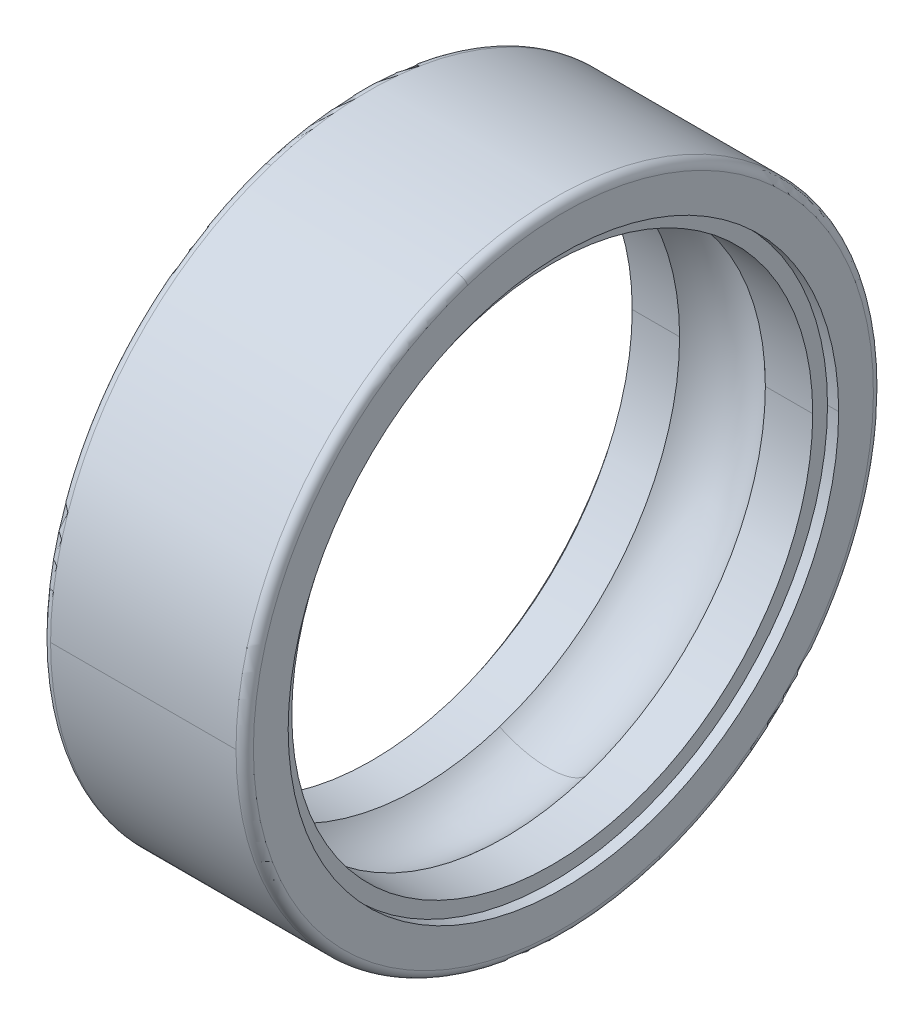
ISO-10303-21;
HEADER;
FILE_DESCRIPTION(('STEP AP214'),'2;1');
FILE_NAME('part.step','',(''),(''),'','','');
FILE_SCHEMA(('AUTOMOTIVE_DESIGN { 1 0 10303 214 1 1 1 1 }'));
ENDSEC;
DATA;
#1=APPLICATION_CONTEXT('core data for automotive mechanical design processes');
#2=APPLICATION_PROTOCOL_DEFINITION('international standard','automotive_design',2000,#1);
#3=PRODUCT_CONTEXT('',#1,'mechanical');
#4=PRODUCT('Part','Part','',(#3));
#5=PRODUCT_RELATED_PRODUCT_CATEGORY('part','',(#4));
#6=PRODUCT_DEFINITION_FORMATION('','',#4);
#7=PRODUCT_DEFINITION_CONTEXT('part definition',#1,'design');
#8=PRODUCT_DEFINITION('design','',#6,#7);
#9=PRODUCT_DEFINITION_SHAPE('','',#8);
#10=(LENGTH_UNIT() NAMED_UNIT(*) SI_UNIT(.MILLI.,.METRE.));
#11=(NAMED_UNIT(*) PLANE_ANGLE_UNIT() SI_UNIT($,.RADIAN.));
#12=(NAMED_UNIT(*) SI_UNIT($,.STERADIAN.) SOLID_ANGLE_UNIT());
#13=UNCERTAINTY_MEASURE_WITH_UNIT(LENGTH_MEASURE(1.E-05),#10,'distance_accuracy_value','');
#14=(GEOMETRIC_REPRESENTATION_CONTEXT(3) GLOBAL_UNCERTAINTY_ASSIGNED_CONTEXT((#13)) GLOBAL_UNIT_ASSIGNED_CONTEXT((#10,
#11,#12)) REPRESENTATION_CONTEXT('',''));
#15=CARTESIAN_POINT('',(0.,0.,0.));
#16=DIRECTION('',(0.,0.,1.));
#17=DIRECTION('',(1.,0.,0.));
#18=AXIS2_PLACEMENT_3D('',#15,#16,#17);
#19=CARTESIAN_POINT('',(0.,10.7,0.));
#20=DIRECTION('',(-1.,0.,0.));
#21=DIRECTION('',(0.,0.,1.));
#22=AXIS2_PLACEMENT_3D('',#19,#20,#21);
#23=PLANE('',#22);
#24=CARTESIAN_POINT('',(0.,0.,0.));
#25=DIRECTION('',(1.,0.,0.));
#26=DIRECTION('',(0.,0.,-1.));
#27=AXIS2_PLACEMENT_3D('',#24,#25,#26);
#28=CIRCLE('',#27,9.5);
#29=CARTESIAN_POINT('',(0.,0.,-9.5));
#30=VERTEX_POINT('',#29);
#31=CARTESIAN_POINT('',(0.,0.,9.5));
#32=VERTEX_POINT('',#31);
#33=EDGE_CURVE('E11',#30,#32,#28,.T.);
#34=ORIENTED_EDGE('',*,*,#33,.T.);
#35=CARTESIAN_POINT('',(0.,0.,0.));
#36=DIRECTION('',(1.,0.,0.));
#37=DIRECTION('',(0.,0.,-1.));
#38=AXIS2_PLACEMENT_3D('',#35,#36,#37);
#39=CIRCLE('',#38,9.5);
#40=EDGE_CURVE('E26',#32,#30,#39,.T.);
#41=ORIENTED_EDGE('',*,*,#40,.T.);
#42=EDGE_LOOP('',(#34,#41));
#43=FACE_BOUND('',#42,.T.);
#44=CARTESIAN_POINT('',(0.,10.1763047243581,3.30648183981196));
#45=CARTESIAN_POINT('',(0.,10.1222060192153,3.4729925522832));
#46=CARTESIAN_POINT('',(0.,10.0640137178569,3.63817284244062));
#47=CARTESIAN_POINT('',(0.,9.93959737326859,3.96548044496034));
#48=CARTESIAN_POINT('',(0.,9.87337333003879,4.12760775732264));
#49=CARTESIAN_POINT('',(0.,9.73304895226789,4.44841727108463));
#50=CARTESIAN_POINT('',(0.,9.65894861772679,4.60709947248432));
#51=CARTESIAN_POINT('',(0.,9.5030512671633,4.92063690146475));
#52=CARTESIAN_POINT('',(0.,9.42125425114093,5.07549212904549));
#53=CARTESIAN_POINT('',(0.,9.2501603002169,5.38100243898939));
#54=CARTESIAN_POINT('',(0.,9.16086336531526,5.53165752135256));
#55=CARTESIAN_POINT('',(0.,8.97498477943333,5.82840462947298));
#56=CARTESIAN_POINT('',(0.,8.87840312845304,5.97449665523024));
#57=CARTESIAN_POINT('',(0.,8.67818776299292,6.26176569364071));
#58=CARTESIAN_POINT('',(0.,8.57455404851308,6.40294270629393));
#59=CARTESIAN_POINT('',(0.,8.36048422439702,6.68004161285399));
#60=CARTESIAN_POINT('',(0.,8.25004811476079,6.81596350676083));
#61=CARTESIAN_POINT('',(0.,8.02263954907983,7.08222472750514));
#62=CARTESIAN_POINT('',(0.,7.90566709303509,7.2125640543426));
#63=CARTESIAN_POINT('',(0.,7.66546763183478,7.46734614224756));
#64=CARTESIAN_POINT('',(0.,7.5422406266792,7.59178890331505));
#65=CARTESIAN_POINT('',(0.,7.28982893179738,7.83447806612745));
#66=CARTESIAN_POINT('',(0.,7.16064424207114,7.95272446787235));
#67=CARTESIAN_POINT('',(0.,6.89662839530991,8.18273604611169));
#68=CARTESIAN_POINT('',(0.,6.76179723827492,8.29450122260611));
#69=CARTESIAN_POINT('',(0.,6.48681327695549,8.51128109824186));
#70=CARTESIAN_POINT('',(0.,6.34666047267106,8.61629579738319));
#71=CARTESIAN_POINT('',(0.,6.0613708572363,8.81932172870511));
#72=CARTESIAN_POINT('',(0.,5.91623404608597,8.91733296088571));
#73=CARTESIAN_POINT('',(0.,5.6213260642094,9.10611584064285));
#74=CARTESIAN_POINT('',(0.,5.47155489348316,9.19688748821941));
#75=CARTESIAN_POINT('',(0.,5.1677390043236,9.37097252191886));
#76=CARTESIAN_POINT('',(0.,5.01369428589029,9.45428590804176));
#77=CARTESIAN_POINT('',(0.,4.70170240853597,9.61325370958933));
#78=CARTESIAN_POINT('',(0.,4.54375524961497,9.688908125014));
#79=CARTESIAN_POINT('',(0.,4.22433899982567,9.83237572705182));
#80=CARTESIAN_POINT('',(0.,4.06286990895737,9.90018891366497));
#81=CARTESIAN_POINT('',(0.,3.73679878845639,10.0278106901734));
#82=CARTESIAN_POINT('',(0.,3.57219675882372,10.0876192800688));
#83=CARTESIAN_POINT('',(0.,3.24025630150081,10.19908777901));
#84=CARTESIAN_POINT('',(0.,3.07291787381057,10.2507476880558));
#85=CARTESIAN_POINT('',(0.,2.73590775330198,10.3457943720523));
#86=CARTESIAN_POINT('',(0.,2.56623606048361,10.3891811470029));
#87=CARTESIAN_POINT('',(0.,2.22496816368822,10.4675770402677));
#88=CARTESIAN_POINT('',(0.,2.0533719597112,10.502586158582));
#89=CARTESIAN_POINT('',(0.,1.70866843088395,10.5641423985417));
#90=CARTESIAN_POINT('',(0.,1.53556110603371,10.5906895201872));
#91=CARTESIAN_POINT('',(0.,1.18825236616799,10.635257812468));
#92=CARTESIAN_POINT('',(0.,1.01405095115252,10.6532789831034));
#93=CARTESIAN_POINT('',(0.,0.664973697423329,10.6807519587855));
#94=CARTESIAN_POINT('',(0.,0.490097858709621,10.6902037638323));
#95=CARTESIAN_POINT('',(0.,0.140093048796752,10.700515238111));
#96=CARTESIAN_POINT('',(0.,-0.0350359224024079,10.7013749073429));
#97=CARTESIAN_POINT('',(0.,-0.385125096255075,10.6945000389733));
#98=CARTESIAN_POINT('',(0.,-0.560085298908583,10.6867655013719));
#99=CARTESIAN_POINT('',(0.,-0.909415441217051,10.6627208525142));
#100=CARTESIAN_POINT('',(0.,-1.08378538087201,10.646410741258));
#101=CARTESIAN_POINT('',(0.,-1.43151492472575,10.6052542375774));
#102=CARTESIAN_POINT('',(0.,-1.60487452892453,10.580407845153));
#103=CARTESIAN_POINT('',(0.,-1.95016576339489,10.5222386362717));
#104=CARTESIAN_POINT('',(0.,-2.12209739366647,10.4889158198147));
#105=CARTESIAN_POINT('',(0.,-2.46411848192566,10.4138740404519));
#106=CARTESIAN_POINT('',(0.,-2.63420793991328,10.372155077546));
#107=CARTESIAN_POINT('',(0.,-2.97213492320218,10.2804215099211));
#108=CARTESIAN_POINT('',(0.,-3.13997244850347,10.230406905202));
#109=CARTESIAN_POINT('',(0.,-3.47299123112044,10.1222025435143));
#110=CARTESIAN_POINT('',(0.,-3.63817248843612,10.0640127865456));
#111=CARTESIAN_POINT('',(0.,-3.96548079896482,9.93959830457988));
#112=CARTESIAN_POINT('',(0.,-4.12760785217784,9.87337357958291));
#113=CARTESIAN_POINT('',(0.,-4.4484171762294,9.73304870272379));
#114=CARTESIAN_POINT('',(0.,-4.60709944706793,9.65894855086165));
#115=CARTESIAN_POINT('',(0.,-4.92063692688112,9.50305133402845));
#116=CARTESIAN_POINT('',(0.,-5.07549213585578,9.42125426905739));
#117=CARTESIAN_POINT('',(0.,-5.38100243217909,9.25016028230045));
#118=CARTESIAN_POINT('',(0.,-5.53165751952774,9.16086336051456));
#119=CARTESIAN_POINT('',(0.,-5.82840463129779,8.97498478423404));
#120=CARTESIAN_POINT('',(0.,-5.97449665571919,8.87840312973939));
#121=CARTESIAN_POINT('',(0.,-6.26176569315174,8.67818776170658));
#122=CARTESIAN_POINT('',(0.,-6.4029427061629,8.57455404816841));
#123=CARTESIAN_POINT('',(0.,-6.68004161298499,8.3604842247417));
#124=CARTESIAN_POINT('',(0.,-6.81596350679593,8.25004811485316));
#125=CARTESIAN_POINT('',(0.,-7.08222472747002,8.02263954898748));
#126=CARTESIAN_POINT('',(0.,-7.21256405433319,7.90566709301036));
#127=CARTESIAN_POINT('',(0.,-7.46734614225696,7.66546763185953));
#128=CARTESIAN_POINT('',(0.,-7.59178890331756,7.54224062668583));
#129=CARTESIAN_POINT('',(0.,-7.83447806612492,7.28982893179075));
#130=CARTESIAN_POINT('',(0.,-7.95272446787167,7.16064424206937));
#131=CARTESIAN_POINT('',(0.,-8.18273604611236,6.89662839531169));
#132=CARTESIAN_POINT('',(0.,-8.29450122260629,6.7617972382754));
#133=CARTESIAN_POINT('',(0.,-8.51128109824167,6.48681327695502));
#134=CARTESIAN_POINT('',(0.,-8.61629579738313,6.34666047267094));
#135=CARTESIAN_POINT('',(0.,-8.81932172870515,6.06137085723643));
#136=CARTESIAN_POINT('',(0.,-8.91733296088571,5.91623404608601));
#137=CARTESIAN_POINT('',(0.,-9.10611584064283,5.62132606420938));
#138=CARTESIAN_POINT('',(0.,-9.1968874882194,5.47155489348316));
#139=CARTESIAN_POINT('',(0.,-9.37097252191886,5.16773900432363));
#140=CARTESIAN_POINT('',(0.,-9.45428590804176,5.0136942858903));
#141=CARTESIAN_POINT('',(0.,-9.61325370958932,4.70170240853598));
#142=CARTESIAN_POINT('',(0.,-9.68890812501399,4.54375524961498));
#143=CARTESIAN_POINT('',(0.,-9.83237572705183,4.22433899982568));
#144=CARTESIAN_POINT('',(0.,-9.900188913665,4.06286990895737));
#145=CARTESIAN_POINT('',(0.,-10.0278106901734,3.73679878845641));
#146=CARTESIAN_POINT('',(0.,-10.0876192800686,3.57219675882376));
#147=CARTESIAN_POINT('',(0.,-10.1990877790101,3.24025630150078));
#148=CARTESIAN_POINT('',(0.,-10.2507476880563,3.07291787381045));
#149=CARTESIAN_POINT('',(0.,-10.3457943720518,2.73590775330212));
#150=CARTESIAN_POINT('',(0.,-10.389181147001,2.56623606048412));
#151=CARTESIAN_POINT('',(0.,-10.4675770402695,2.22496816368773));
#152=CARTESIAN_POINT('',(0.,-10.5025861585888,2.05337195970936));
#153=CARTESIAN_POINT('',(0.,-10.5641423985349,1.70866843088582));
#154=CARTESIAN_POINT('',(0.,-10.5906895201616,1.53556110604065));
#155=CARTESIAN_POINT('',(0.,-10.6352578124936,1.18825236616106));
#156=CARTESIAN_POINT('',(0.,-10.6532789831988,1.01405095112664));
#157=CARTESIAN_POINT('',(0.,-10.6807519586902,0.66497369744922));
#158=CARTESIAN_POINT('',(0.,-10.6902037634764,0.49009785880623));
#159=CARTESIAN_POINT('',(0.,-10.7005152384668,0.140093048700162));
#160=CARTESIAN_POINT('',(0.,-10.7013749086709,-0.0350359227629166));
#161=CARTESIAN_POINT('',(0.,-10.6945000376453,-0.385125095894546));
#162=CARTESIAN_POINT('',(0.,-10.6867654964154,-0.560085297563097));
#163=CARTESIAN_POINT('',(0.,-10.6627208574707,-0.909415442562518));
#164=CARTESIAN_POINT('',(0.,-10.6464107597557,-1.08378538589339));
#165=CARTESIAN_POINT('',(0.,-10.6052542190797,-1.43151491970436));
#166=CARTESIAN_POINT('',(0.,-10.5804077761186,-1.60487451018446));
#167=CARTESIAN_POINT('',(0.,-10.5222387053061,-1.95016578213494));
#168=CARTESIAN_POINT('',(0.,-10.4889160774547,-2.12209746360532));
#169=CARTESIAN_POINT('',(0.,-10.413873782812,-2.46411841198679));
#170=CARTESIAN_POINT('',(0.,-10.3721541160207,-2.63420767889787));
#171=CARTESIAN_POINT('',(0.,-10.2804224714464,-2.97213518421757));
#172=CARTESIAN_POINT('',(0.,-10.2304104936632,-3.13997342262617));
#173=CARTESIAN_POINT('',(0.,-10.1763047243581,-3.30648183981194));
#174=B_SPLINE_CURVE_WITH_KNOTS('',3,(#44,#45,#46,#47,#48,#49,#50,#51,#52,#53,#54,#55,#56,#57,
#58,#59,#60,#61,#62,#63,#64,#65,#66,#67,#68,#69,#70,#71,#72,#73,#74,#75,#76,#77,#78,#79,#80,#81,
#82,#83,#84,#85,#86,#87,#88,#89,#90,#91,#92,#93,#94,#95,#96,#97,#98,#99,#100,#101,#102,#103,
#104,#105,#106,#107,#108,#109,#110,#111,#112,#113,#114,#115,#116,#117,#118,#119,#120,#121,#122,
#123,#124,#125,#126,#127,#128,#129,#130,#131,#132,#133,#134,#135,#136,#137,#138,#139,#140,#141,
#142,#143,#144,#145,#146,#147,#148,#149,#150,#151,#152,#153,#154,#155,#156,#157,#158,#159,#160,
#161,#162,#163,#164,#165,#166,#167,#168,#169,#170,#171,#172,#173),.UNSPECIFIED.,.F.,.F.,(4,2,2,
2,2,2,2,2,2,2,2,2,2,2,2,2,2,2,2,2,2,2,2,2,2,2,2,2,2,2,2,2,2,2,2,2,2,2,2,2,2,2,2,2,2,2,2,2,2,2,2,
2,2,2,2,2,2,2,2,2,2,2,2,2,4),(0.,0.52518229039032,1.05036458078064,1.57554687117097,
2.10072916156129,2.62591145195161,3.15109374234194,3.67627603273226,4.20145832312258,
4.7266406135129,5.25182290390323,5.77700519429355,6.30218748468387,6.82736977507419,
7.35255206546451,7.87773435585484,8.40291664624516,8.92809893663548,9.4532812270258,
9.97846351741613,10.5036458078064,11.0288280981968,11.5540103885871,12.0791926789774,
12.6043749693677,13.1295572597581,13.6547395501484,14.1799218405387,14.705104130929,
15.2302864213194,15.7554687117097,16.2806510021,16.8058332924903,17.3310155828806,
17.856197873271,18.3813801636613,18.9065624540516,19.4317447444419,19.9569270348323,
20.4821093252226,21.0072916156129,21.5324739060032,22.0576561963935,22.5828384867839,
23.1080207771742,23.6332030675645,24.1583853579548,24.6835676483452,25.2087499387355,
25.7339322291258,26.2591145195161,26.7842968099065,27.3094791002968,27.8346613906871,
28.3598436810774,28.8850259714678,29.4102082618581,29.9353905522484,30.4605728426387,
30.985755133029,31.5109374234194,32.0361197138097,32.5613020042,33.0864842945903,
33.6116665849807),.UNSPECIFIED.);
#175=CARTESIAN_POINT('',(0.,10.1763047243581,3.30648183981194));
#176=VERTEX_POINT('',#175);
#177=CARTESIAN_POINT('',(0.,-10.1763047243581,-3.30648183981193));
#178=VERTEX_POINT('',#177);
#179=EDGE_CURVE('E318',#176,#178,#174,.T.);
#180=ORIENTED_EDGE('',*,*,#179,.F.);
#181=CARTESIAN_POINT('',(0.,-10.1763047243581,-3.30648183981196));
#182=CARTESIAN_POINT('',(0.,-10.1222060192153,-3.4729925522832));
#183=CARTESIAN_POINT('',(0.,-10.0640137178569,-3.63817284244062));
#184=CARTESIAN_POINT('',(0.,-9.93959737326859,-3.96548044496034));
#185=CARTESIAN_POINT('',(0.,-9.87337333003879,-4.12760775732264));
#186=CARTESIAN_POINT('',(0.,-9.73304895226789,-4.44841727108463));
#187=CARTESIAN_POINT('',(0.,-9.65894861772679,-4.60709947248432));
#188=CARTESIAN_POINT('',(0.,-9.50305126716331,-4.92063690146475));
#189=CARTESIAN_POINT('',(0.,-9.42125425114093,-5.07549212904549));
#190=CARTESIAN_POINT('',(0.,-9.2501603002169,-5.38100243898939));
#191=CARTESIAN_POINT('',(0.,-9.16086336531526,-5.53165752135256));
#192=CARTESIAN_POINT('',(0.,-8.97498477943333,-5.82840462947298));
#193=CARTESIAN_POINT('',(0.,-8.87840312845305,-5.97449665523023));
#194=CARTESIAN_POINT('',(0.,-8.67818776299292,-6.2617656936407));
#195=CARTESIAN_POINT('',(0.,-8.57455404851308,-6.40294270629392));
#196=CARTESIAN_POINT('',(0.,-8.36048422439702,-6.68004161285398));
#197=CARTESIAN_POINT('',(0.,-8.2500481147608,-6.81596350676083));
#198=CARTESIAN_POINT('',(0.,-8.02263954907984,-7.08222472750514));
#199=CARTESIAN_POINT('',(0.,-7.9056670930351,-7.2125640543426));
#200=CARTESIAN_POINT('',(0.,-7.66546763183478,-7.46734614224755));
#201=CARTESIAN_POINT('',(0.,-7.5422406266792,-7.59178890331504));
#202=CARTESIAN_POINT('',(0.,-7.28982893179738,-7.83447806612744));
#203=CARTESIAN_POINT('',(0.,-7.16064424207114,-7.95272446787235));
#204=CARTESIAN_POINT('',(0.,-6.89662839530992,-8.18273604611168));
#205=CARTESIAN_POINT('',(0.,-6.76179723827492,-8.2945012226061));
#206=CARTESIAN_POINT('',(0.,-6.4868132769555,-8.51128109824185));
#207=CARTESIAN_POINT('',(0.,-6.34666047267107,-8.61629579738318));
#208=CARTESIAN_POINT('',(0.,-6.06137085723631,-8.81932172870511));
#209=CARTESIAN_POINT('',(0.,-5.91623404608598,-8.9173329608857));
#210=CARTESIAN_POINT('',(0.,-5.62132606420941,-9.10611584064285));
#211=CARTESIAN_POINT('',(0.,-5.47155489348317,-9.1968874882194));
#212=CARTESIAN_POINT('',(0.,-5.16773900432361,-9.37097252191885));
#213=CARTESIAN_POINT('',(0.,-5.0136942858903,-9.45428590804176));
#214=CARTESIAN_POINT('',(0.,-4.70170240853598,-9.61325370958933));
#215=CARTESIAN_POINT('',(0.,-4.54375524961498,-9.688908125014));
#216=CARTESIAN_POINT('',(0.,-4.22433899982568,-9.83237572705182));
#217=CARTESIAN_POINT('',(0.,-4.06286990895738,-9.90018891366496));
#218=CARTESIAN_POINT('',(0.,-3.7367987884564,-10.0278106901734));
#219=CARTESIAN_POINT('',(0.,-3.57219675882373,-10.0876192800688));
#220=CARTESIAN_POINT('',(0.,-3.24025630150082,-10.19908777901));
#221=CARTESIAN_POINT('',(0.,-3.07291787381059,-10.2507476880558));
#222=CARTESIAN_POINT('',(0.,-2.73590775330199,-10.3457943720523));
#223=CARTESIAN_POINT('',(0.,-2.56623606048362,-10.3891811470029));
#224=CARTESIAN_POINT('',(0.,-2.22496816368823,-10.4675770402677));
#225=CARTESIAN_POINT('',(0.,-2.05337195971121,-10.502586158582));
#226=CARTESIAN_POINT('',(0.,-1.70866843088396,-10.5641423985417));
#227=CARTESIAN_POINT('',(0.,-1.53556110603372,-10.5906895201872));
#228=CARTESIAN_POINT('',(0.,-1.18825236616801,-10.635257812468));
#229=CARTESIAN_POINT('',(0.,-1.01405095115253,-10.6532789831034));
#230=CARTESIAN_POINT('',(0.,-0.664973697423343,-10.6807519587855));
#231=CARTESIAN_POINT('',(0.,-0.490097858709633,-10.6902037638323));
#232=CARTESIAN_POINT('',(0.,-0.140093048796764,-10.700515238111));
#233=CARTESIAN_POINT('',(0.,0.035035922402394,-10.7013749073429));
#234=CARTESIAN_POINT('',(0.,0.38512509625506,-10.6945000389733));
#235=CARTESIAN_POINT('',(0.,0.560085298908567,-10.6867655013719));
#236=CARTESIAN_POINT('',(0.,0.909415441217034,-10.6627208525142));
#237=CARTESIAN_POINT('',(0.,1.08378538087199,-10.646410741258));
#238=CARTESIAN_POINT('',(0.,1.43151492472573,-10.6052542375774));
#239=CARTESIAN_POINT('',(0.,1.60487452892451,-10.580407845153));
#240=CARTESIAN_POINT('',(0.,1.95016576339487,-10.5222386362717));
#241=CARTESIAN_POINT('',(0.,2.12209739366645,-10.4889158198147));
#242=CARTESIAN_POINT('',(0.,2.46411848192564,-10.4138740404519));
#243=CARTESIAN_POINT('',(0.,2.63420793991326,-10.372155077546));
#244=CARTESIAN_POINT('',(0.,2.97213492320216,-10.2804215099211));
#245=CARTESIAN_POINT('',(0.,3.13997244850345,-10.230406905202));
#246=CARTESIAN_POINT('',(0.,3.47299123112042,-10.1222025435143));
#247=CARTESIAN_POINT('',(0.,3.6381724884361,-10.0640127865456));
#248=CARTESIAN_POINT('',(0.,3.9654807989648,-9.93959830457989));
#249=CARTESIAN_POINT('',(0.,4.12760785217782,-9.87337357958291));
#250=CARTESIAN_POINT('',(0.,4.44841717622938,-9.7330487027238));
#251=CARTESIAN_POINT('',(0.,4.60709944706791,-9.65894855086166));
#252=CARTESIAN_POINT('',(0.,4.9206369268811,-9.50305133402846));
#253=CARTESIAN_POINT('',(0.,5.07549213585576,-9.4212542690574));
#254=CARTESIAN_POINT('',(0.,5.38100243217907,-9.25016028230046));
#255=CARTESIAN_POINT('',(0.,5.53165751952772,-9.16086336051458));
#256=CARTESIAN_POINT('',(0.,5.82840463129777,-8.97498478423405));
#257=CARTESIAN_POINT('',(0.,5.97449665571916,-8.87840312973941));
#258=CARTESIAN_POINT('',(0.,6.26176569315172,-8.67818776170659));
#259=CARTESIAN_POINT('',(0.,6.40294270616288,-8.57455404816842));
#260=CARTESIAN_POINT('',(0.,6.68004161298497,-8.36048422474171));
#261=CARTESIAN_POINT('',(0.,6.81596350679591,-8.25004811485317));
#262=CARTESIAN_POINT('',(0.,7.08222472747001,-8.0226395489875));
#263=CARTESIAN_POINT('',(0.,7.21256405433317,-7.90566709301037));
#264=CARTESIAN_POINT('',(0.,7.46734614225694,-7.66546763185954));
#265=CARTESIAN_POINT('',(0.,7.59178890331754,-7.54224062668585));
#266=CARTESIAN_POINT('',(0.,7.8344780661249,-7.28982893179077));
#267=CARTESIAN_POINT('',(0.,7.95272446787165,-7.16064424206939));
#268=CARTESIAN_POINT('',(0.,8.18273604611234,-6.89662839531171));
#269=CARTESIAN_POINT('',(0.,8.29450122260627,-6.76179723827542));
#270=CARTESIAN_POINT('',(0.,8.51128109824166,-6.48681327695505));
#271=CARTESIAN_POINT('',(0.,8.61629579738312,-6.34666047267096));
#272=CARTESIAN_POINT('',(0.,8.81932172870514,-6.06137085723646));
#273=CARTESIAN_POINT('',(0.,8.9173329608857,-5.91623404608604));
#274=CARTESIAN_POINT('',(0.,9.10611584064282,-5.6213260642094));
#275=CARTESIAN_POINT('',(0.,9.19688748821938,-5.47155489348319));
#276=CARTESIAN_POINT('',(0.,9.37097252191884,-5.16773900432365));
#277=CARTESIAN_POINT('',(0.,9.45428590804174,-5.01369428589033));
#278=CARTESIAN_POINT('',(0.,9.61325370958931,-4.70170240853601));
#279=CARTESIAN_POINT('',(0.,9.68890812501398,-4.54375524961501));
#280=CARTESIAN_POINT('',(0.,9.83237572705182,-4.2243389998257));
#281=CARTESIAN_POINT('',(0.,9.90018891366499,-4.06286990895739));
#282=CARTESIAN_POINT('',(0.,10.0278106901734,-3.73679878845644));
#283=CARTESIAN_POINT('',(0.,10.0876192800686,-3.57219675882379));
#284=CARTESIAN_POINT('',(0.,10.1990877790101,-3.24025630150081));
#285=CARTESIAN_POINT('',(0.,10.2507476880563,-3.07291787381048));
#286=CARTESIAN_POINT('',(0.,10.3457943720518,-2.73590775330215));
#287=CARTESIAN_POINT('',(0.,10.389181147001,-2.56623606048414));
#288=CARTESIAN_POINT('',(0.,10.4675770402695,-2.22496816368776));
#289=CARTESIAN_POINT('',(0.,10.5025861585888,-2.05337195970938));
#290=CARTESIAN_POINT('',(0.,10.5641423985349,-1.70866843088585));
#291=CARTESIAN_POINT('',(0.,10.5906895201616,-1.53556110604069));
#292=CARTESIAN_POINT('',(0.,10.6352578124936,-1.1882523661611));
#293=CARTESIAN_POINT('',(0.,10.6532789831988,-1.01405095112668));
#294=CARTESIAN_POINT('',(0.,10.6807519586902,-0.66497369744926));
#295=CARTESIAN_POINT('',(0.,10.6902037634764,-0.490097858806269));
#296=CARTESIAN_POINT('',(0.,10.7005152384668,-0.140093048700201));
#297=CARTESIAN_POINT('',(0.,10.7013749086709,0.0350359227628772));
#298=CARTESIAN_POINT('',(0.,10.6945000376453,0.385125095894506));
#299=CARTESIAN_POINT('',(0.,10.6867654964154,0.560085297563057));
#300=CARTESIAN_POINT('',(0.,10.6627208574707,0.909415442562479));
#301=CARTESIAN_POINT('',(0.,10.6464107597557,1.08378538589335));
#302=CARTESIAN_POINT('',(0.,10.6052542190797,1.43151491970432));
#303=CARTESIAN_POINT('',(0.,10.5804077761186,1.60487451018442));
#304=CARTESIAN_POINT('',(0.,10.5222387053061,1.9501657821349));
#305=CARTESIAN_POINT('',(0.,10.4889160774547,2.12209746360528));
#306=CARTESIAN_POINT('',(0.,10.413873782812,2.46411841198675));
#307=CARTESIAN_POINT('',(0.,10.3721541160208,2.63420767889784));
#308=CARTESIAN_POINT('',(0.,10.2804224714464,2.97213518421753));
#309=CARTESIAN_POINT('',(0.,10.2304104936632,3.13997342262613));
#310=CARTESIAN_POINT('',(0.,10.1763047243582,3.30648183981191));
#311=B_SPLINE_CURVE_WITH_KNOTS('',3,(#181,#182,#183,#184,#185,#186,#187,#188,#189,#190,#191,
#192,#193,#194,#195,#196,#197,#198,#199,#200,#201,#202,#203,#204,#205,#206,#207,#208,#209,#210,
#211,#212,#213,#214,#215,#216,#217,#218,#219,#220,#221,#222,#223,#224,#225,#226,#227,#228,#229,
#230,#231,#232,#233,#234,#235,#236,#237,#238,#239,#240,#241,#242,#243,#244,#245,#246,#247,#248,
#249,#250,#251,#252,#253,#254,#255,#256,#257,#258,#259,#260,#261,#262,#263,#264,#265,#266,#267,
#268,#269,#270,#271,#272,#273,#274,#275,#276,#277,#278,#279,#280,#281,#282,#283,#284,#285,#286,
#287,#288,#289,#290,#291,#292,#293,#294,#295,#296,#297,#298,#299,#300,#301,#302,#303,#304,#305,
#306,#307,#308,#309,#310),.UNSPECIFIED.,.F.,.F.,(4,2,2,2,2,2,2,2,2,2,2,2,2,2,2,2,2,2,2,2,2,2,2,
2,2,2,2,2,2,2,2,2,2,2,2,2,2,2,2,2,2,2,2,2,2,2,2,2,2,2,2,2,2,2,2,2,2,2,2,2,2,2,2,2,4),(0.,
0.52518229039032,1.05036458078064,1.57554687117097,2.10072916156129,2.62591145195161,
3.15109374234193,3.67627603273225,4.20145832312258,4.7266406135129,5.25182290390322,
5.77700519429354,6.30218748468386,6.82736977507418,7.35255206546451,7.87773435585483,
8.40291664624515,8.92809893663547,9.4532812270258,9.97846351741612,10.5036458078064,
11.0288280981968,11.5540103885871,12.0791926789774,12.6043749693677,13.1295572597581,
13.6547395501484,14.1799218405387,14.705104130929,15.2302864213193,15.7554687117097,
16.2806510021,16.8058332924903,17.3310155828806,17.856197873271,18.3813801636613,
18.9065624540516,19.4317447444419,19.9569270348322,20.4821093252226,21.0072916156129,
21.5324739060032,22.0576561963935,22.5828384867838,23.1080207771742,23.6332030675645,
24.1583853579548,24.6835676483451,25.2087499387355,25.7339322291258,26.2591145195161,
26.7842968099064,27.3094791002968,27.8346613906871,28.3598436810774,28.8850259714677,
29.410208261858,29.9353905522484,30.4605728426387,30.985755133029,31.5109374234193,
32.0361197138097,32.5613020042,33.0864842945903,33.6116665849806),.UNSPECIFIED.);
#312=EDGE_CURVE('E420',#178,#176,#311,.T.);
#313=ORIENTED_EDGE('',*,*,#312,.F.);
#314=EDGE_LOOP('',(#180,#313));
#315=FACE_BOUND('',#314,.T.);
#316=ADVANCED_FACE('F17',(#43,#315),#23,.T.);
#317=CARTESIAN_POINT('',(0.299999999999936,0.,0.));
#318=DIRECTION('',(1.,0.,0.));
#319=DIRECTION('',(0.,-0.309016994374947,0.951056516295154));
#320=AXIS2_PLACEMENT_3D('',#317,#318,#319);
#321=TOROIDAL_SURFACE('',#320,10.7,0.299999999999936);
#322=CARTESIAN_POINT('',(0.299999999999936,-10.1763047243581,-3.30648183981193));
#323=DIRECTION('',(0.,0.309016994374948,-0.951056516295154));
#324=DIRECTION('',(2.11682523361907E-13,-0.951056516295154,-0.309016994374948));
#325=AXIS2_PLACEMENT_3D('',#322,#323,#324);
#326=CIRCLE('',#325,0.299999999999937);
#327=CARTESIAN_POINT('',(0.3,-10.4616216792466,-3.3991869381244));
#328=VERTEX_POINT('',#327);
#329=EDGE_CURVE('E383',#328,#178,#326,.T.);
#330=ORIENTED_EDGE('',*,*,#329,.T.);
#331=ORIENTED_EDGE('',*,*,#312,.T.);
#332=CARTESIAN_POINT('',(0.299999999999936,10.1763047243581,3.30648183981194));
#333=DIRECTION('',(0.,-0.309016994374948,0.951056516295154));
#334=DIRECTION('',(2.11682523361907E-13,0.951056516295154,0.309016994374948));
#335=AXIS2_PLACEMENT_3D('',#332,#333,#334);
#336=CIRCLE('',#335,0.299999999999937);
#337=CARTESIAN_POINT('',(0.3,10.4616216792466,3.3991869381244));
#338=VERTEX_POINT('',#337);
#339=EDGE_CURVE('E379',#338,#176,#336,.T.);
#340=ORIENTED_EDGE('',*,*,#339,.F.);
#341=CARTESIAN_POINT('',(0.3,0.,0.));
#342=DIRECTION('',(1.,0.,0.));
#343=DIRECTION('',(0.,0.,-1.));
#344=AXIS2_PLACEMENT_3D('',#341,#342,#343);
#345=CIRCLE('',#344,11.);
#346=CARTESIAN_POINT('',(0.3,0.,-11.));
#347=VERTEX_POINT('',#346);
#348=EDGE_CURVE('E374',#347,#338,#345,.T.);
#349=ORIENTED_EDGE('',*,*,#348,.F.);
#350=CARTESIAN_POINT('',(0.3,0.,0.));
#351=DIRECTION('',(1.,0.,0.));
#352=DIRECTION('',(0.,0.,-1.));
#353=AXIS2_PLACEMENT_3D('',#350,#351,#352);
#354=CIRCLE('',#353,11.);
#355=EDGE_CURVE('E369',#328,#347,#354,.T.);
#356=ORIENTED_EDGE('',*,*,#355,.F.);
#357=EDGE_LOOP('',(#330,#331,#340,#349,#356));
#358=FACE_BOUND('',#357,.T.);
#359=ADVANCED_FACE('F391',(#358),#321,.T.);
#360=CARTESIAN_POINT('',(7.,0.,0.));
#361=DIRECTION('',(1.,0.,0.));
#362=DIRECTION('',(0.,1.,0.));
#363=AXIS2_PLACEMENT_3D('',#360,#361,#362);
#364=CYLINDRICAL_SURFACE('',#363,11.);
#365=DIRECTION('',(1.,0.,0.));
#366=VECTOR('',#365,1.);
#367=CARTESIAN_POINT('',(0.3,0.,11.));
#368=LINE('',#367,#366);
#369=CARTESIAN_POINT('',(0.3,0.,11.));
#370=VERTEX_POINT('',#369);
#371=CARTESIAN_POINT('',(6.7,0.,11.));
#372=VERTEX_POINT('',#371);
#373=EDGE_CURVE('E364',#370,#372,#368,.T.);
#374=ORIENTED_EDGE('',*,*,#373,.F.);
#375=CARTESIAN_POINT('',(0.3,0.,0.));
#376=DIRECTION('',(1.,0.,0.));
#377=DIRECTION('',(0.,0.,-1.));
#378=AXIS2_PLACEMENT_3D('',#375,#376,#377);
#379=CIRCLE('',#378,11.);
#380=EDGE_CURVE('E359',#370,#328,#379,.T.);
#381=ORIENTED_EDGE('',*,*,#380,.T.);
#382=ORIENTED_EDGE('',*,*,#355,.T.);
#383=DIRECTION('',(1.,0.,0.));
#384=VECTOR('',#383,1.);
#385=CARTESIAN_POINT('',(0.3,0.,-11.));
#386=LINE('',#385,#384);
#387=CARTESIAN_POINT('',(6.7,0.,-11.));
#388=VERTEX_POINT('',#387);
#389=EDGE_CURVE('E355',#347,#388,#386,.T.);
#390=ORIENTED_EDGE('',*,*,#389,.T.);
#391=CARTESIAN_POINT('',(6.7,0.,0.));
#392=DIRECTION('',(1.,0.,0.));
#393=DIRECTION('',(0.,0.,-1.));
#394=AXIS2_PLACEMENT_3D('',#391,#392,#393);
#395=CIRCLE('',#394,11.);
#396=CARTESIAN_POINT('',(6.7,-10.4616216792467,-3.39918693812442));
#397=VERTEX_POINT('',#396);
#398=EDGE_CURVE('E350',#397,#388,#395,.T.);
#399=ORIENTED_EDGE('',*,*,#398,.F.);
#400=CARTESIAN_POINT('',(6.7,0.,0.));
#401=DIRECTION('',(1.,0.,0.));
#402=DIRECTION('',(0.,0.,-1.));
#403=AXIS2_PLACEMENT_3D('',#400,#401,#402);
#404=CIRCLE('',#403,11.);
#405=EDGE_CURVE('E345',#372,#397,#404,.T.);
#406=ORIENTED_EDGE('',*,*,#405,.F.);
#407=EDGE_LOOP('',(#374,#381,#382,#390,#399,#406));
#408=FACE_BOUND('',#407,.T.);
#409=ADVANCED_FACE('F400',(#408),#364,.T.);
#410=CARTESIAN_POINT('',(6.70000000000013,0.,0.));
#411=DIRECTION('',(1.,0.,0.));
#412=DIRECTION('',(0.,0.309016994374947,-0.951056516295154));
#413=AXIS2_PLACEMENT_3D('',#410,#411,#412);
#414=TOROIDAL_SURFACE('',#413,10.7000000000001,0.299999999999875);
#415=CARTESIAN_POINT('',(6.70000000000013,-10.1763047243583,-3.30648183981197));
#416=DIRECTION('',(0.,0.309016994374947,-0.951056516295154));
#417=DIRECTION('',(1.,0.,0.));
#418=AXIS2_PLACEMENT_3D('',#415,#416,#417);
#419=CIRCLE('',#418,0.299999999999875);
#420=CARTESIAN_POINT('',(7.00000000000001,-10.1763047243583,-3.30648183981197));
#421=VERTEX_POINT('',#420);
#422=EDGE_CURVE('E341',#421,#397,#419,.T.);
#423=ORIENTED_EDGE('',*,*,#422,.F.);
#424=CARTESIAN_POINT('',(7.,0.,0.));
#425=DIRECTION('',(1.,0.,0.));
#426=DIRECTION('',(0.,0.,-1.));
#427=AXIS2_PLACEMENT_3D('',#424,#425,#426);
#428=CIRCLE('',#427,10.7);
#429=CARTESIAN_POINT('',(7.00000000000001,10.1763047243583,3.30648183981197));
#430=VERTEX_POINT('',#429);
#431=EDGE_CURVE('E336',#430,#421,#428,.T.);
#432=ORIENTED_EDGE('',*,*,#431,.F.);
#433=CARTESIAN_POINT('',(6.70000000000013,10.1763047243583,3.30648183981197));
#434=DIRECTION('',(0.,-0.309016994374947,0.951056516295154));
#435=DIRECTION('',(1.,0.,0.));
#436=AXIS2_PLACEMENT_3D('',#433,#434,#435);
#437=CIRCLE('',#436,0.299999999999875);
#438=CARTESIAN_POINT('',(6.7,10.4616216792467,3.39918693812442));
#439=VERTEX_POINT('',#438);
#440=EDGE_CURVE('E332',#430,#439,#437,.T.);
#441=ORIENTED_EDGE('',*,*,#440,.T.);
#442=CARTESIAN_POINT('',(6.7,0.,0.));
#443=DIRECTION('',(1.,0.,0.));
#444=DIRECTION('',(0.,0.,-1.));
#445=AXIS2_PLACEMENT_3D('',#442,#443,#444);
#446=CIRCLE('',#445,11.);
#447=EDGE_CURVE('E327',#439,#372,#446,.T.);
#448=ORIENTED_EDGE('',*,*,#447,.T.);
#449=ORIENTED_EDGE('',*,*,#405,.T.);
#450=EDGE_LOOP('',(#423,#432,#441,#448,#449));
#451=FACE_BOUND('',#450,.T.);
#452=ADVANCED_FACE('F404',(#451),#414,.T.);
#453=CARTESIAN_POINT('',(7.,0.,0.));
#454=DIRECTION('',(1.,0.,0.));
#455=DIRECTION('',(0.,-1.,0.));
#456=AXIS2_PLACEMENT_3D('',#453,#454,#455);
#457=CYLINDRICAL_SURFACE('',#456,11.);
#458=ORIENTED_EDGE('',*,*,#373,.T.);
#459=ORIENTED_EDGE('',*,*,#447,.F.);
#460=CARTESIAN_POINT('',(6.7,0.,0.));
#461=DIRECTION('',(1.,0.,0.));
#462=DIRECTION('',(0.,0.,-1.));
#463=AXIS2_PLACEMENT_3D('',#460,#461,#462);
#464=CIRCLE('',#463,11.);
#465=EDGE_CURVE('E322',#388,#439,#464,.T.);
#466=ORIENTED_EDGE('',*,*,#465,.F.);
#467=ORIENTED_EDGE('',*,*,#389,.F.);
#468=ORIENTED_EDGE('',*,*,#348,.T.);
#469=CARTESIAN_POINT('',(0.3,0.,0.));
#470=DIRECTION('',(1.,0.,0.));
#471=DIRECTION('',(0.,0.,-1.));
#472=AXIS2_PLACEMENT_3D('',#469,#470,#471);
#473=CIRCLE('',#472,11.);
#474=EDGE_CURVE('E319',#338,#370,#473,.T.);
#475=ORIENTED_EDGE('',*,*,#474,.T.);
#476=EDGE_LOOP('',(#458,#459,#466,#467,#468,#475));
#477=FACE_BOUND('',#476,.T.);
#478=ADVANCED_FACE('F407',(#477),#457,.T.);
#479=CARTESIAN_POINT('',(0.299999999999936,0.,0.));
#480=DIRECTION('',(1.,0.,0.));
#481=DIRECTION('',(0.,0.309016994374947,-0.951056516295154));
#482=AXIS2_PLACEMENT_3D('',#479,#480,#481);
#483=TOROIDAL_SURFACE('',#482,10.7,0.299999999999936);
#484=ORIENTED_EDGE('',*,*,#329,.F.);
#485=ORIENTED_EDGE('',*,*,#380,.F.);
#486=ORIENTED_EDGE('',*,*,#474,.F.);
#487=ORIENTED_EDGE('',*,*,#339,.T.);
#488=ORIENTED_EDGE('',*,*,#179,.T.);
#489=EDGE_LOOP('',(#484,#485,#486,#487,#488));
#490=FACE_BOUND('',#489,.T.);
#491=ADVANCED_FACE('F289',(#490),#483,.T.);
#492=CARTESIAN_POINT('',(6.70000000000013,0.,0.));
#493=DIRECTION('',(1.,0.,0.));
#494=DIRECTION('',(0.,-0.309016994374947,0.951056516295154));
#495=AXIS2_PLACEMENT_3D('',#492,#493,#494);
#496=TOROIDAL_SURFACE('',#495,10.7000000000001,0.299999999999875);
#497=ORIENTED_EDGE('',*,*,#422,.T.);
#498=ORIENTED_EDGE('',*,*,#398,.T.);
#499=ORIENTED_EDGE('',*,*,#465,.T.);
#500=ORIENTED_EDGE('',*,*,#440,.F.);
#501=CARTESIAN_POINT('',(7.,-10.1763047243581,-3.30648183981194));
#502=CARTESIAN_POINT('',(7.,-9.65690267624749,-4.90495709132963));
#503=CARTESIAN_POINT('',(7.,-8.82377001746347,-6.4015449288719));
#504=CARTESIAN_POINT('',(7.,-7.70303591347207,-7.71368525089797));
#505=CARTESIAN_POINT('',(7.,-5.00749251702068,-9.82775367064837));
#506=CARTESIAN_POINT('',(7.,-1.71277244133918,-10.7658866430674));
#507=CARTESIAN_POINT('',(7.,0.00753062996819778,-10.9012803646003));
#508=CARTESIAN_POINT('',(7.,3.40843865374229,-10.4900955320945));
#509=CARTESIAN_POINT('',(7.,6.40151942179496,-8.82374746864334));
#510=CARTESIAN_POINT('',(7.,7.713691409188,-7.70304287220367));
#511=CARTESIAN_POINT('',(7.,9.82775521624545,-5.00748948361563));
#512=CARTESIAN_POINT('',(7.,10.7658773935832,-1.71277154941768));
#513=CARTESIAN_POINT('',(7.,10.9013135996627,0.00752324817339112));
#514=CARTESIAN_POINT('',(7.,10.6956598195201,1.7079913323564));
#515=CARTESIAN_POINT('',(7.,10.1763047243581,3.30648183981193));
#516=B_SPLINE_CURVE_WITH_KNOTS('',5,(#501,#502,#503,#504,#505,#506,#507,#508,#509,#510,#511,
#512,#513,#514,#515),.UNSPECIFIED.,.F.,.F.,(6,3,3,3,6),(0.,0.785398163397448,1.5707963267949,
2.35619449019234,3.14159265358979),.UNSPECIFIED.);
#517=EDGE_CURVE('E263',#421,#430,#516,.T.);
#518=ORIENTED_EDGE('',*,*,#517,.F.);
#519=EDGE_LOOP('',(#497,#498,#499,#500,#518));
#520=FACE_BOUND('',#519,.T.);
#521=ADVANCED_FACE('F283',(#520),#496,.T.);
#522=CARTESIAN_POINT('',(7.,9.5,0.));
#523=DIRECTION('',(1.,0.,0.));
#524=DIRECTION('',(0.,0.,-1.));
#525=AXIS2_PLACEMENT_3D('',#522,#523,#524);
#526=PLANE('',#525);
#527=ORIENTED_EDGE('',*,*,#431,.T.);
#528=ORIENTED_EDGE('',*,*,#517,.T.);
#529=EDGE_LOOP('',(#527,#528));
#530=FACE_BOUND('',#529,.T.);
#531=CARTESIAN_POINT('',(7.,0.,0.));
#532=DIRECTION('',(1.,0.,0.));
#533=DIRECTION('',(0.,0.,-1.));
#534=AXIS2_PLACEMENT_3D('',#531,#532,#533);
#535=CIRCLE('',#534,9.5);
#536=CARTESIAN_POINT('',(7.,0.,9.5));
#537=VERTEX_POINT('',#536);
#538=CARTESIAN_POINT('',(7.,0.,-9.5));
#539=VERTEX_POINT('',#538);
#540=EDGE_CURVE('E258',#537,#539,#535,.T.);
#541=ORIENTED_EDGE('',*,*,#540,.F.);
#542=CARTESIAN_POINT('',(7.,0.,0.));
#543=DIRECTION('',(1.,0.,0.));
#544=DIRECTION('',(0.,0.,-1.));
#545=AXIS2_PLACEMENT_3D('',#542,#543,#544);
#546=CIRCLE('',#545,9.5);
#547=EDGE_CURVE('E253',#539,#537,#546,.T.);
#548=ORIENTED_EDGE('',*,*,#547,.F.);
#549=EDGE_LOOP('',(#541,#548));
#550=FACE_BOUND('',#549,.T.);
#551=ADVANCED_FACE('F272',(#530,#550),#526,.T.);
#552=CARTESIAN_POINT('',(7.,0.,0.));
#553=DIRECTION('',(1.,0.,0.));
#554=DIRECTION('',(0.,-1.,0.));
#555=AXIS2_PLACEMENT_3D('',#552,#553,#554);
#556=CYLINDRICAL_SURFACE('',#555,9.5);
#557=DIRECTION('',(1.,0.,0.));
#558=VECTOR('',#557,1.);
#559=CARTESIAN_POINT('',(6.615,0.,9.5));
#560=LINE('',#559,#558);
#561=CARTESIAN_POINT('',(6.615,0.,9.5));
#562=VERTEX_POINT('',#561);
#563=EDGE_CURVE('E248',#562,#537,#560,.T.);
#564=ORIENTED_EDGE('',*,*,#563,.F.);
#565=CARTESIAN_POINT('',(6.615,0.,0.));
#566=DIRECTION('',(1.,0.,0.));
#567=DIRECTION('',(0.,0.,-1.));
#568=AXIS2_PLACEMENT_3D('',#565,#566,#567);
#569=CIRCLE('',#568,9.5);
#570=CARTESIAN_POINT('',(6.615,0.,-9.5));
#571=VERTEX_POINT('',#570);
#572=EDGE_CURVE('E243',#571,#562,#569,.T.);
#573=ORIENTED_EDGE('',*,*,#572,.F.);
#574=DIRECTION('',(1.,0.,0.));
#575=VECTOR('',#574,1.);
#576=CARTESIAN_POINT('',(6.615,0.,-9.5));
#577=LINE('',#576,#575);
#578=EDGE_CURVE('E238',#571,#539,#577,.T.);
#579=ORIENTED_EDGE('',*,*,#578,.T.);
#580=ORIENTED_EDGE('',*,*,#547,.T.);
#581=EDGE_LOOP('',(#564,#573,#579,#580));
#582=FACE_BOUND('',#581,.T.);
#583=ADVANCED_FACE('F282',(#582),#556,.F.);
#584=CARTESIAN_POINT('',(7.,0.,0.));
#585=DIRECTION('',(1.,0.,0.));
#586=DIRECTION('',(0.,1.,0.));
#587=AXIS2_PLACEMENT_3D('',#584,#585,#586);
#588=CYLINDRICAL_SURFACE('',#587,9.5);
#589=ORIENTED_EDGE('',*,*,#563,.T.);
#590=ORIENTED_EDGE('',*,*,#540,.T.);
#591=ORIENTED_EDGE('',*,*,#578,.F.);
#592=CARTESIAN_POINT('',(6.615,0.,0.));
#593=DIRECTION('',(1.,0.,0.));
#594=DIRECTION('',(0.,0.,-1.));
#595=AXIS2_PLACEMENT_3D('',#592,#593,#594);
#596=CIRCLE('',#595,9.5);
#597=EDGE_CURVE('E233',#562,#571,#596,.T.);
#598=ORIENTED_EDGE('',*,*,#597,.F.);
#599=EDGE_LOOP('',(#589,#590,#591,#598));
#600=FACE_BOUND('',#599,.T.);
#601=ADVANCED_FACE('F451',(#600),#588,.F.);
#602=CARTESIAN_POINT('',(6.615,8.99,0.));
#603=DIRECTION('',(1.,0.,0.));
#604=DIRECTION('',(0.,0.,-1.));
#605=AXIS2_PLACEMENT_3D('',#602,#603,#604);
#606=PLANE('',#605);
#607=ORIENTED_EDGE('',*,*,#572,.T.);
#608=ORIENTED_EDGE('',*,*,#597,.T.);
#609=EDGE_LOOP('',(#607,#608));
#610=FACE_BOUND('',#609,.T.);
#611=CARTESIAN_POINT('',(6.615,0.,0.));
#612=DIRECTION('',(1.,0.,0.));
#613=DIRECTION('',(0.,0.,-1.));
#614=AXIS2_PLACEMENT_3D('',#611,#612,#613);
#615=CIRCLE('',#614,8.99);
#616=CARTESIAN_POINT('',(6.615,0.,8.99));
#617=VERTEX_POINT('',#616);
#618=CARTESIAN_POINT('',(6.615,0.,-8.99));
#619=VERTEX_POINT('',#618);
#620=EDGE_CURVE('E228',#617,#619,#615,.T.);
#621=ORIENTED_EDGE('',*,*,#620,.F.);
#622=CARTESIAN_POINT('',(6.615,0.,0.));
#623=DIRECTION('',(1.,0.,0.));
#624=DIRECTION('',(0.,0.,-1.));
#625=AXIS2_PLACEMENT_3D('',#622,#623,#624);
#626=CIRCLE('',#625,8.99);
#627=EDGE_CURVE('E223',#619,#617,#626,.T.);
#628=ORIENTED_EDGE('',*,*,#627,.F.);
#629=EDGE_LOOP('',(#621,#628));
#630=FACE_BOUND('',#629,.T.);
#631=ADVANCED_FACE('F454',(#610,#630),#606,.T.);
#632=CARTESIAN_POINT('',(7.,0.,0.));
#633=DIRECTION('',(1.,0.,0.));
#634=DIRECTION('',(0.,-1.,0.));
#635=AXIS2_PLACEMENT_3D('',#632,#633,#634);
#636=CYLINDRICAL_SURFACE('',#635,8.99);
#637=DIRECTION('',(1.,0.,0.));
#638=VECTOR('',#637,1.);
#639=CARTESIAN_POINT('',(4.9798310714403,0.,8.99));
#640=LINE('',#639,#638);
#641=CARTESIAN_POINT('',(4.9798310714403,0.,8.99));
#642=VERTEX_POINT('',#641);
#643=EDGE_CURVE('E218',#642,#617,#640,.T.);
#644=ORIENTED_EDGE('',*,*,#643,.F.);
#645=CARTESIAN_POINT('',(4.9798310714403,0.,0.));
#646=DIRECTION('',(1.,0.,0.));
#647=DIRECTION('',(0.,0.,-1.));
#648=AXIS2_PLACEMENT_3D('',#645,#646,#647);
#649=CIRCLE('',#648,8.99);
#650=CARTESIAN_POINT('',(4.9798310714403,8.54999808149343,2.77806277943078));
#651=VERTEX_POINT('',#650);
#652=EDGE_CURVE('E213',#651,#642,#649,.T.);
#653=ORIENTED_EDGE('',*,*,#652,.F.);
#654=CARTESIAN_POINT('',(4.9798310714403,0.,0.));
#655=DIRECTION('',(1.,0.,0.));
#656=DIRECTION('',(0.,0.,-1.));
#657=AXIS2_PLACEMENT_3D('',#654,#655,#656);
#658=CIRCLE('',#657,8.99);
#659=CARTESIAN_POINT('',(4.9798310714403,0.,-8.99));
#660=VERTEX_POINT('',#659);
#661=EDGE_CURVE('E208',#660,#651,#658,.T.);
#662=ORIENTED_EDGE('',*,*,#661,.F.);
#663=DIRECTION('',(1.,0.,0.));
#664=VECTOR('',#663,1.);
#665=CARTESIAN_POINT('',(4.9798310714403,0.,-8.99));
#666=LINE('',#665,#664);
#667=EDGE_CURVE('E203',#660,#619,#666,.T.);
#668=ORIENTED_EDGE('',*,*,#667,.T.);
#669=ORIENTED_EDGE('',*,*,#627,.T.);
#670=EDGE_LOOP('',(#644,#653,#662,#668,#669));
#671=FACE_BOUND('',#670,.T.);
#672=ADVANCED_FACE('F457',(#671),#636,.F.);
#673=CARTESIAN_POINT('',(7.,0.,0.));
#674=DIRECTION('',(1.,0.,0.));
#675=DIRECTION('',(0.,1.,0.));
#676=AXIS2_PLACEMENT_3D('',#673,#674,#675);
#677=CYLINDRICAL_SURFACE('',#676,8.99);
#678=ORIENTED_EDGE('',*,*,#643,.T.);
#679=ORIENTED_EDGE('',*,*,#620,.T.);
#680=ORIENTED_EDGE('',*,*,#667,.F.);
#681=CARTESIAN_POINT('',(4.9798310714403,0.,0.));
#682=DIRECTION('',(1.,0.,0.));
#683=DIRECTION('',(0.,0.,-1.));
#684=AXIS2_PLACEMENT_3D('',#681,#682,#683);
#685=CIRCLE('',#684,8.99);
#686=CARTESIAN_POINT('',(4.9798310714403,-8.54999808149343,-2.77806277943078));
#687=VERTEX_POINT('',#686);
#688=EDGE_CURVE('E198',#687,#660,#685,.T.);
#689=ORIENTED_EDGE('',*,*,#688,.F.);
#690=CARTESIAN_POINT('',(4.9798310714403,0.,0.));
#691=DIRECTION('',(1.,0.,0.));
#692=DIRECTION('',(0.,0.,-1.));
#693=AXIS2_PLACEMENT_3D('',#690,#691,#692);
#694=CIRCLE('',#693,8.99);
#695=EDGE_CURVE('E193',#642,#687,#694,.T.);
#696=ORIENTED_EDGE('',*,*,#695,.F.);
#697=EDGE_LOOP('',(#678,#679,#680,#689,#696));
#698=FACE_BOUND('',#697,.T.);
#699=ADVANCED_FACE('F462',(#698),#677,.F.);
#700=CARTESIAN_POINT('',(3.5,0.,0.));
#701=DIRECTION('',(1.,0.,0.));
#702=DIRECTION('',(0.,0.309016994374947,-0.951056516295154));
#703=AXIS2_PLACEMENT_3D('',#700,#701,#702);
#704=TOROIDAL_SURFACE('',#703,7.49999999999988,2.10000000000012);
#705=CARTESIAN_POINT('',(3.5,-7.13292387221354,-2.31762745781207));
#706=DIRECTION('',(0.,0.309016994374947,-0.951056516295154));
#707=DIRECTION('',(0.704681462590578,-0.674797242514197,-0.219254915056516));
#708=AXIS2_PLACEMENT_3D('',#705,#706,#707);
#709=CIRCLE('',#708,2.10000000000012);
#710=CARTESIAN_POINT('',(2.0201689285597,-8.54999808149343,-2.77806277943078));
#711=VERTEX_POINT('',#710);
#712=EDGE_CURVE('E189',#687,#711,#709,.T.);
#713=ORIENTED_EDGE('',*,*,#712,.T.);
#714=CARTESIAN_POINT('',(2.0201689285597,0.,0.));
#715=DIRECTION('',(1.,0.,0.));
#716=DIRECTION('',(0.,0.,-1.));
#717=AXIS2_PLACEMENT_3D('',#714,#715,#716);
#718=CIRCLE('',#717,8.99);
#719=CARTESIAN_POINT('',(2.0201689285597,0.,8.99));
#720=VERTEX_POINT('',#719);
#721=EDGE_CURVE('E184',#720,#711,#718,.T.);
#722=ORIENTED_EDGE('',*,*,#721,.F.);
#723=CARTESIAN_POINT('',(2.0201689285597,0.,0.));
#724=DIRECTION('',(1.,0.,0.));
#725=DIRECTION('',(0.,0.,-1.));
#726=AXIS2_PLACEMENT_3D('',#723,#724,#725);
#727=CIRCLE('',#726,8.99);
#728=CARTESIAN_POINT('',(2.0201689285597,8.54999808149343,2.77806277943078));
#729=VERTEX_POINT('',#728);
#730=EDGE_CURVE('E179',#729,#720,#727,.T.);
#731=ORIENTED_EDGE('',*,*,#730,.F.);
#732=CARTESIAN_POINT('',(3.5,7.13292387221354,2.31762745781207));
#733=DIRECTION('',(0.,-0.309016994374947,0.951056516295154));
#734=DIRECTION('',(0.704681462590579,0.674797242514196,0.219254915056515));
#735=AXIS2_PLACEMENT_3D('',#732,#733,#734);
#736=CIRCLE('',#735,2.10000000000012);
#737=EDGE_CURVE('E174',#651,#729,#736,.T.);
#738=ORIENTED_EDGE('',*,*,#737,.F.);
#739=ORIENTED_EDGE('',*,*,#652,.T.);
#740=ORIENTED_EDGE('',*,*,#695,.T.);
#741=EDGE_LOOP('',(#713,#722,#731,#738,#739,#740));
#742=FACE_BOUND('',#741,.T.);
#743=ADVANCED_FACE('F469',(#742),#704,.F.);
#744=CARTESIAN_POINT('',(3.5,0.,0.));
#745=DIRECTION('',(1.,0.,0.));
#746=DIRECTION('',(0.,-0.309016994374947,0.951056516295154));
#747=AXIS2_PLACEMENT_3D('',#744,#745,#746);
#748=TOROIDAL_SURFACE('',#747,7.49999999999988,2.10000000000012);
#749=ORIENTED_EDGE('',*,*,#712,.F.);
#750=ORIENTED_EDGE('',*,*,#688,.T.);
#751=ORIENTED_EDGE('',*,*,#661,.T.);
#752=ORIENTED_EDGE('',*,*,#737,.T.);
#753=CARTESIAN_POINT('',(2.0201689285597,0.,0.));
#754=DIRECTION('',(1.,0.,0.));
#755=DIRECTION('',(0.,0.,-1.));
#756=AXIS2_PLACEMENT_3D('',#753,#754,#755);
#757=CIRCLE('',#756,8.99);
#758=CARTESIAN_POINT('',(2.0201689285597,0.,-8.99));
#759=VERTEX_POINT('',#758);
#760=EDGE_CURVE('E169',#759,#729,#757,.T.);
#761=ORIENTED_EDGE('',*,*,#760,.F.);
#762=CARTESIAN_POINT('',(2.0201689285597,0.,0.));
#763=DIRECTION('',(1.,0.,0.));
#764=DIRECTION('',(0.,0.,-1.));
#765=AXIS2_PLACEMENT_3D('',#762,#763,#764);
#766=CIRCLE('',#765,8.99);
#767=EDGE_CURVE('E164',#711,#759,#766,.T.);
#768=ORIENTED_EDGE('',*,*,#767,.F.);
#769=EDGE_LOOP('',(#749,#750,#751,#752,#761,#768));
#770=FACE_BOUND('',#769,.T.);
#771=ADVANCED_FACE('F466',(#770),#748,.F.);
#772=CARTESIAN_POINT('',(7.,0.,0.));
#773=DIRECTION('',(1.,0.,0.));
#774=DIRECTION('',(0.,1.,0.));
#775=AXIS2_PLACEMENT_3D('',#772,#773,#774);
#776=CYLINDRICAL_SURFACE('',#775,8.99);
#777=DIRECTION('',(1.,0.,0.));
#778=VECTOR('',#777,1.);
#779=CARTESIAN_POINT('',(0.385,0.,8.99));
#780=LINE('',#779,#778);
#781=CARTESIAN_POINT('',(0.385,0.,8.99));
#782=VERTEX_POINT('',#781);
#783=EDGE_CURVE('E159',#782,#720,#780,.T.);
#784=ORIENTED_EDGE('',*,*,#783,.T.);
#785=ORIENTED_EDGE('',*,*,#721,.T.);
#786=ORIENTED_EDGE('',*,*,#767,.T.);
#787=DIRECTION('',(1.,0.,0.));
#788=VECTOR('',#787,1.);
#789=CARTESIAN_POINT('',(0.385000000000002,0.,-8.99));
#790=LINE('',#789,#788);
#791=CARTESIAN_POINT('',(0.385,0.,-8.99));
#792=VERTEX_POINT('',#791);
#793=EDGE_CURVE('E154',#792,#759,#790,.T.);
#794=ORIENTED_EDGE('',*,*,#793,.F.);
#795=CARTESIAN_POINT('',(0.385,0.,0.));
#796=DIRECTION('',(1.,0.,0.));
#797=DIRECTION('',(0.,0.,-1.));
#798=AXIS2_PLACEMENT_3D('',#795,#796,#797);
#799=CIRCLE('',#798,8.99);
#800=EDGE_CURVE('E143',#782,#792,#799,.T.);
#801=ORIENTED_EDGE('',*,*,#800,.F.);
#802=EDGE_LOOP('',(#784,#785,#786,#794,#801));
#803=FACE_BOUND('',#802,.T.);
#804=ADVANCED_FACE('F473',(#803),#776,.F.);
#805=CARTESIAN_POINT('',(0.385,9.5,0.));
#806=DIRECTION('',(-1.,0.,0.));
#807=DIRECTION('',(0.,0.,1.));
#808=AXIS2_PLACEMENT_3D('',#805,#806,#807);
#809=PLANE('',#808);
#810=CARTESIAN_POINT('',(0.385,0.,0.));
#811=DIRECTION('',(1.,0.,0.));
#812=DIRECTION('',(0.,0.,-1.));
#813=AXIS2_PLACEMENT_3D('',#810,#811,#812);
#814=CIRCLE('',#813,8.99);
#815=EDGE_CURVE('E140',#792,#782,#814,.T.);
#816=ORIENTED_EDGE('',*,*,#815,.T.);
#817=ORIENTED_EDGE('',*,*,#800,.T.);
#818=EDGE_LOOP('',(#816,#817));
#819=FACE_BOUND('',#818,.T.);
#820=CARTESIAN_POINT('',(0.385,0.,0.));
#821=DIRECTION('',(1.,0.,0.));
#822=DIRECTION('',(0.,0.,-1.));
#823=AXIS2_PLACEMENT_3D('',#820,#821,#822);
#824=CIRCLE('',#823,9.5);
#825=CARTESIAN_POINT('',(0.385,0.,9.5));
#826=VERTEX_POINT('',#825);
#827=CARTESIAN_POINT('',(0.385,0.,-9.5));
#828=VERTEX_POINT('',#827);
#829=EDGE_CURVE('E128',#826,#828,#824,.T.);
#830=ORIENTED_EDGE('',*,*,#829,.F.);
#831=CARTESIAN_POINT('',(0.385,0.,0.));
#832=DIRECTION('',(1.,0.,0.));
#833=DIRECTION('',(0.,0.,-1.));
#834=AXIS2_PLACEMENT_3D('',#831,#832,#833);
#835=CIRCLE('',#834,9.5);
#836=EDGE_CURVE('E124',#828,#826,#835,.T.);
#837=ORIENTED_EDGE('',*,*,#836,.F.);
#838=EDGE_LOOP('',(#830,#837));
#839=FACE_BOUND('',#838,.T.);
#840=ADVANCED_FACE('F126',(#819,#839),#809,.T.);
#841=CARTESIAN_POINT('',(7.,0.,0.));
#842=DIRECTION('',(1.,0.,0.));
#843=DIRECTION('',(0.,-1.,0.));
#844=AXIS2_PLACEMENT_3D('',#841,#842,#843);
#845=CYLINDRICAL_SURFACE('',#844,9.5);
#846=DIRECTION('',(1.,0.,0.));
#847=VECTOR('',#846,1.);
#848=CARTESIAN_POINT('',(0.,0.,9.5));
#849=LINE('',#848,#847);
#850=EDGE_CURVE('E132',#32,#826,#849,.T.);
#851=ORIENTED_EDGE('',*,*,#850,.F.);
#852=ORIENTED_EDGE('',*,*,#33,.F.);
#853=DIRECTION('',(1.,0.,0.));
#854=VECTOR('',#853,1.);
#855=CARTESIAN_POINT('',(0.,0.,-9.5));
#856=LINE('',#855,#854);
#857=EDGE_CURVE('E135',#30,#828,#856,.T.);
#858=ORIENTED_EDGE('',*,*,#857,.T.);
#859=ORIENTED_EDGE('',*,*,#836,.T.);
#860=EDGE_LOOP('',(#851,#852,#858,#859));
#861=FACE_BOUND('',#860,.T.);
#862=ADVANCED_FACE('F136',(#861),#845,.F.);
#863=CARTESIAN_POINT('',(7.,0.,0.));
#864=DIRECTION('',(1.,0.,0.));
#865=DIRECTION('',(0.,1.,0.));
#866=AXIS2_PLACEMENT_3D('',#863,#864,#865);
#867=CYLINDRICAL_SURFACE('',#866,9.5);
#868=ORIENTED_EDGE('',*,*,#850,.T.);
#869=ORIENTED_EDGE('',*,*,#829,.T.);
#870=ORIENTED_EDGE('',*,*,#857,.F.);
#871=ORIENTED_EDGE('',*,*,#40,.F.);
#872=EDGE_LOOP('',(#868,#869,#870,#871));
#873=FACE_BOUND('',#872,.T.);
#874=ADVANCED_FACE('F139',(#873),#867,.F.);
#875=CARTESIAN_POINT('',(7.,0.,0.));
#876=DIRECTION('',(1.,0.,0.));
#877=DIRECTION('',(0.,-1.,0.));
#878=AXIS2_PLACEMENT_3D('',#875,#876,#877);
#879=CYLINDRICAL_SURFACE('',#878,8.99);
#880=ORIENTED_EDGE('',*,*,#783,.F.);
#881=ORIENTED_EDGE('',*,*,#815,.F.);
#882=ORIENTED_EDGE('',*,*,#793,.T.);
#883=ORIENTED_EDGE('',*,*,#760,.T.);
#884=ORIENTED_EDGE('',*,*,#730,.T.);
#885=EDGE_LOOP('',(#880,#881,#882,#883,#884));
#886=FACE_BOUND('',#885,.T.);
#887=ADVANCED_FACE('F476',(#886),#879,.F.);
#888=CLOSED_SHELL('',(#316,#359,#409,#452,#478,#491,#521,#551,#583,#601,#631,#672,#699,#743,
#771,#804,#840,#862,#874,#887));
#889=MANIFOLD_SOLID_BREP('B1',#888);
#890=ADVANCED_BREP_SHAPE_REPRESENTATION('',(#18,#889),#14);
#891=SHAPE_DEFINITION_REPRESENTATION(#9,#890);
ENDSEC;
END-ISO-10303-21;
